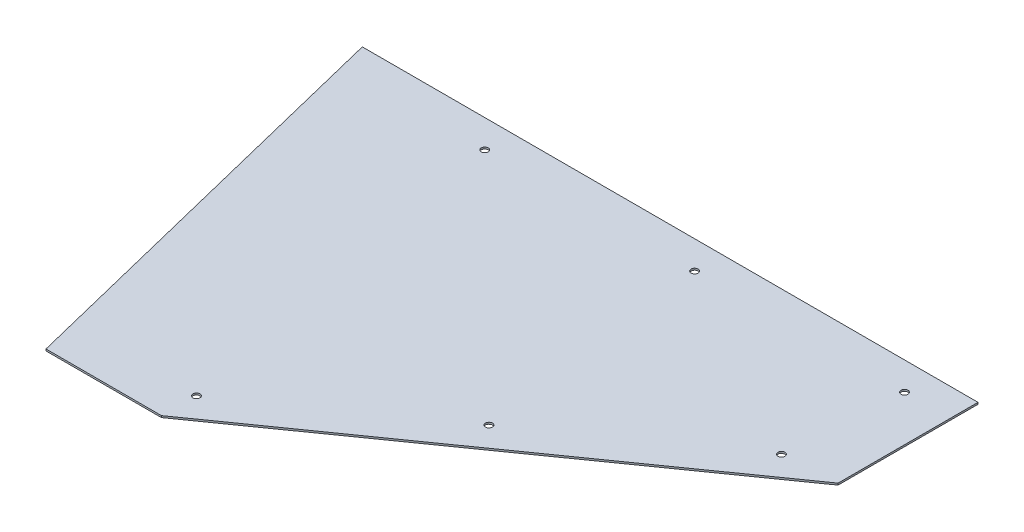
ISO-10303-21;
HEADER;
FILE_DESCRIPTION(('STEP AP214'),'2;1');
FILE_NAME('part.step','',(''),(''),'','','');
FILE_SCHEMA(('AUTOMOTIVE_DESIGN { 1 0 10303 214 1 1 1 1 }'));
ENDSEC;
DATA;
#1=APPLICATION_CONTEXT('core data for automotive mechanical design processes');
#2=APPLICATION_PROTOCOL_DEFINITION('international standard','automotive_design',2000,#1);
#3=PRODUCT_CONTEXT('',#1,'mechanical');
#4=PRODUCT('Part','Part','',(#3));
#5=PRODUCT_RELATED_PRODUCT_CATEGORY('part','',(#4));
#6=PRODUCT_DEFINITION_FORMATION('','',#4);
#7=PRODUCT_DEFINITION_CONTEXT('part definition',#1,'design');
#8=PRODUCT_DEFINITION('design','',#6,#7);
#9=PRODUCT_DEFINITION_SHAPE('','',#8);
#10=(LENGTH_UNIT() NAMED_UNIT(*) SI_UNIT(.MILLI.,.METRE.));
#11=(NAMED_UNIT(*) PLANE_ANGLE_UNIT() SI_UNIT($,.RADIAN.));
#12=(NAMED_UNIT(*) SI_UNIT($,.STERADIAN.) SOLID_ANGLE_UNIT());
#13=UNCERTAINTY_MEASURE_WITH_UNIT(LENGTH_MEASURE(1.E-05),#10,'distance_accuracy_value','');
#14=(GEOMETRIC_REPRESENTATION_CONTEXT(3) GLOBAL_UNCERTAINTY_ASSIGNED_CONTEXT((#13)) GLOBAL_UNIT_ASSIGNED_CONTEXT((#10,
#11,#12)) REPRESENTATION_CONTEXT('',''));
#15=CARTESIAN_POINT('',(0.,0.,0.));
#16=DIRECTION('',(0.,0.,1.));
#17=DIRECTION('',(1.,0.,0.));
#18=AXIS2_PLACEMENT_3D('',#15,#16,#17);
#19=CARTESIAN_POINT('',(-187.782690592478,3.175,-762.));
#20=DIRECTION('',(0.970951717770214,0.,-0.239275493436062));
#21=DIRECTION('',(-0.239275493436062,0.,-0.970951717770214));
#22=AXIS2_PLACEMENT_3D('',#19,#20,#21);
#23=PLANE('',#22);
#24=DIRECTION('',(0.239275493436062,0.,0.970951717770214));
#25=VECTOR('',#24,1.);
#26=CARTESIAN_POINT('',(-187.782690592478,0.,-762.));
#27=LINE('',#26,#25);
#28=CARTESIAN_POINT('',(-187.782690592478,0.,-762.));
#29=VERTEX_POINT('',#28);
#30=CARTESIAN_POINT('',(0.,0.,0.));
#31=VERTEX_POINT('',#30);
#32=EDGE_CURVE('E91',#29,#31,#27,.T.);
#33=ORIENTED_EDGE('',*,*,#32,.T.);
#34=DIRECTION('',(0.,-1.,0.));
#35=VECTOR('',#34,1.);
#36=CARTESIAN_POINT('',(0.,3.175,0.));
#37=LINE('',#36,#35);
#38=CARTESIAN_POINT('',(0.,3.175,0.));
#39=VERTEX_POINT('',#38);
#40=EDGE_CURVE('E11',#39,#31,#37,.T.);
#41=ORIENTED_EDGE('',*,*,#40,.F.);
#42=DIRECTION('',(0.239275493436062,0.,0.970951717770214));
#43=VECTOR('',#42,1.);
#44=CARTESIAN_POINT('',(-187.782690592478,3.175,-762.));
#45=LINE('',#44,#43);
#46=CARTESIAN_POINT('',(-187.782690592478,3.175,-762.));
#47=VERTEX_POINT('',#46);
#48=EDGE_CURVE('E100',#47,#39,#45,.T.);
#49=ORIENTED_EDGE('',*,*,#48,.F.);
#50=DIRECTION('',(0.,-1.,0.));
#51=VECTOR('',#50,1.);
#52=CARTESIAN_POINT('',(-187.782690592478,3.175,-762.));
#53=LINE('',#52,#51);
#54=EDGE_CURVE('E87',#47,#29,#53,.T.);
#55=ORIENTED_EDGE('',*,*,#54,.T.);
#56=EDGE_LOOP('',(#33,#41,#49,#55));
#57=FACE_BOUND('',#56,.T.);
#58=ADVANCED_FACE('F17',(#57),#23,.F.);
#59=CARTESIAN_POINT('',(0.,3.175,0.));
#60=DIRECTION('',(0.,0.,-1.));
#61=DIRECTION('',(-1.,0.,0.));
#62=AXIS2_PLACEMENT_3D('',#59,#60,#61);
#63=PLANE('',#62);
#64=DIRECTION('',(1.,0.,0.));
#65=VECTOR('',#64,1.);
#66=CARTESIAN_POINT('',(0.,0.,0.));
#67=LINE('',#66,#65);
#68=CARTESIAN_POINT('',(209.454195022671,0.,0.));
#69=VERTEX_POINT('',#68);
#70=EDGE_CURVE('E94',#31,#69,#67,.T.);
#71=ORIENTED_EDGE('',*,*,#70,.T.);
#72=DIRECTION('',(0.,-1.,0.));
#73=VECTOR('',#72,1.);
#74=CARTESIAN_POINT('',(209.454195022671,3.175,0.));
#75=LINE('',#74,#73);
#76=CARTESIAN_POINT('',(209.454195022671,3.175,0.));
#77=VERTEX_POINT('',#76);
#78=EDGE_CURVE('E25',#77,#69,#75,.T.);
#79=ORIENTED_EDGE('',*,*,#78,.F.);
#80=DIRECTION('',(1.,0.,0.));
#81=VECTOR('',#80,1.);
#82=CARTESIAN_POINT('',(0.,3.175,0.));
#83=LINE('',#82,#81);
#84=EDGE_CURVE('E67',#39,#77,#83,.T.);
#85=ORIENTED_EDGE('',*,*,#84,.F.);
#86=ORIENTED_EDGE('',*,*,#40,.T.);
#87=EDGE_LOOP('',(#71,#79,#85,#86));
#88=FACE_BOUND('',#87,.T.);
#89=ADVANCED_FACE('F122',(#88),#63,.F.);
#90=CARTESIAN_POINT('',(929.817309407521,3.175,-508.));
#91=DIRECTION('',(-0.576310896991402,0.,-0.817230536635144));
#92=DIRECTION('',(-0.817230536635144,0.,0.576310896991402));
#93=AXIS2_PLACEMENT_3D('',#90,#91,#92);
#94=PLANE('',#93);
#95=DIRECTION('',(0.817230536635144,0.,-0.576310896991402));
#96=VECTOR('',#95,1.);
#97=CARTESIAN_POINT('',(929.817309407521,0.,-508.));
#98=LINE('',#97,#96);
#99=CARTESIAN_POINT('',(929.817309407521,0.,-508.));
#100=VERTEX_POINT('',#99);
#101=EDGE_CURVE('E82',#69,#100,#98,.T.);
#102=ORIENTED_EDGE('',*,*,#101,.T.);
#103=DIRECTION('',(0.,-1.,0.));
#104=VECTOR('',#103,1.);
#105=CARTESIAN_POINT('',(929.817309407521,3.175,-508.));
#106=LINE('',#105,#104);
#107=CARTESIAN_POINT('',(929.817309407521,3.175,-508.));
#108=VERTEX_POINT('',#107);
#109=EDGE_CURVE('E79',#108,#100,#106,.T.);
#110=ORIENTED_EDGE('',*,*,#109,.F.);
#111=DIRECTION('',(0.817230536635144,0.,-0.576310896991402));
#112=VECTOR('',#111,1.);
#113=CARTESIAN_POINT('',(929.817309407521,3.175,-508.));
#114=LINE('',#113,#112);
#115=EDGE_CURVE('E71',#77,#108,#114,.T.);
#116=ORIENTED_EDGE('',*,*,#115,.F.);
#117=ORIENTED_EDGE('',*,*,#78,.T.);
#118=EDGE_LOOP('',(#102,#110,#116,#117));
#119=FACE_BOUND('',#118,.T.);
#120=ADVANCED_FACE('F80',(#119),#94,.F.);
#121=CARTESIAN_POINT('',(929.817309407521,3.175,-762.));
#122=DIRECTION('',(-1.,0.,0.));
#123=DIRECTION('',(0.,0.,1.));
#124=AXIS2_PLACEMENT_3D('',#121,#122,#123);
#125=PLANE('',#124);
#126=DIRECTION('',(0.,0.,-1.));
#127=VECTOR('',#126,1.);
#128=CARTESIAN_POINT('',(929.817309407521,0.,-762.));
#129=LINE('',#128,#127);
#130=CARTESIAN_POINT('',(929.817309407521,0.,-762.));
#131=VERTEX_POINT('',#130);
#132=EDGE_CURVE('E53',#100,#131,#129,.T.);
#133=ORIENTED_EDGE('',*,*,#132,.T.);
#134=DIRECTION('',(0.,-1.,0.));
#135=VECTOR('',#134,1.);
#136=CARTESIAN_POINT('',(929.817309407521,3.175,-762.));
#137=LINE('',#136,#135);
#138=CARTESIAN_POINT('',(929.817309407521,3.175,-762.));
#139=VERTEX_POINT('',#138);
#140=EDGE_CURVE('E83',#139,#131,#137,.T.);
#141=ORIENTED_EDGE('',*,*,#140,.F.);
#142=DIRECTION('',(0.,0.,-1.));
#143=VECTOR('',#142,1.);
#144=CARTESIAN_POINT('',(929.817309407521,3.175,-762.));
#145=LINE('',#144,#143);
#146=EDGE_CURVE('E75',#108,#139,#145,.T.);
#147=ORIENTED_EDGE('',*,*,#146,.F.);
#148=ORIENTED_EDGE('',*,*,#109,.T.);
#149=EDGE_LOOP('',(#133,#141,#147,#148));
#150=FACE_BOUND('',#149,.T.);
#151=ADVANCED_FACE('F85',(#150),#125,.F.);
#152=CARTESIAN_POINT('',(929.817309407521,3.175,-762.));
#153=DIRECTION('',(0.,0.,1.));
#154=DIRECTION('',(1.,0.,0.));
#155=AXIS2_PLACEMENT_3D('',#152,#153,#154);
#156=PLANE('',#155);
#157=DIRECTION('',(-1.,0.,0.));
#158=VECTOR('',#157,1.);
#159=CARTESIAN_POINT('',(929.817309407521,0.,-762.));
#160=LINE('',#159,#158);
#161=EDGE_CURVE('E59',#131,#29,#160,.T.);
#162=ORIENTED_EDGE('',*,*,#161,.T.);
#163=ORIENTED_EDGE('',*,*,#54,.F.);
#164=DIRECTION('',(-1.,0.,0.));
#165=VECTOR('',#164,1.);
#166=CARTESIAN_POINT('',(929.817309407521,3.175,-762.));
#167=LINE('',#166,#165);
#168=EDGE_CURVE('E33',#139,#47,#167,.T.);
#169=ORIENTED_EDGE('',*,*,#168,.F.);
#170=ORIENTED_EDGE('',*,*,#140,.T.);
#171=EDGE_LOOP('',(#162,#163,#169,#170));
#172=FACE_BOUND('',#171,.T.);
#173=ADVANCED_FACE('F108',(#172),#156,.F.);
#174=CARTESIAN_POINT('',(0.,3.175,0.));
#175=DIRECTION('',(0.,1.,0.));
#176=DIRECTION('',(0.,0.,1.));
#177=AXIS2_PLACEMENT_3D('',#174,#175,#176);
#178=PLANE('',#177);
#179=CARTESIAN_POINT('',(210.348666125147,3.175,-62.7919432069763));
#180=DIRECTION('',(0.,1.,0.));
#181=DIRECTION('',(0.,0.,1.));
#182=AXIS2_PLACEMENT_3D('',#179,#180,#181);
#183=CIRCLE('',#182,6.35);
#184=CARTESIAN_POINT('',(210.348666125147,3.175,-56.4419432069763));
#185=VERTEX_POINT('',#184);
#186=EDGE_CURVE('E231',#185,#185,#183,.T.);
#187=ORIENTED_EDGE('',*,*,#186,.F.);
#188=EDGE_LOOP('',(#187));
#189=FACE_BOUND('',#188,.T.);
#190=CARTESIAN_POINT('',(521.713500583137,3.175,-282.366394960701));
#191=DIRECTION('',(0.,1.,0.));
#192=DIRECTION('',(0.,0.,1.));
#193=AXIS2_PLACEMENT_3D('',#190,#191,#192);
#194=CIRCLE('',#193,6.35);
#195=CARTESIAN_POINT('',(521.713500583137,3.175,-276.0163949607));
#196=VERTEX_POINT('',#195);
#197=EDGE_CURVE('E235',#196,#196,#194,.T.);
#198=ORIENTED_EDGE('',*,*,#197,.F.);
#199=EDGE_LOOP('',(#198));
#200=FACE_BOUND('',#199,.T.);
#201=CARTESIAN_POINT('',(833.078335041127,3.175,-501.940846714425));
#202=DIRECTION('',(0.,1.,0.));
#203=DIRECTION('',(0.,0.,1.));
#204=AXIS2_PLACEMENT_3D('',#201,#202,#203);
#205=CIRCLE('',#204,6.35);
#206=CARTESIAN_POINT('',(833.078335041127,3.175,-495.590846714425));
#207=VERTEX_POINT('',#206);
#208=EDGE_CURVE('E244',#207,#207,#205,.T.);
#209=ORIENTED_EDGE('',*,*,#208,.F.);
#210=EDGE_LOOP('',(#209));
#211=FACE_BOUND('',#210,.T.);
#212=CARTESIAN_POINT('',(85.2673094075211,3.175,-711.2));
#213=DIRECTION('',(0.,1.,0.));
#214=DIRECTION('',(0.,0.,1.));
#215=AXIS2_PLACEMENT_3D('',#212,#213,#214);
#216=CIRCLE('',#215,6.35);
#217=CARTESIAN_POINT('',(85.2673094075211,3.175,-704.85));
#218=VERTEX_POINT('',#217);
#219=EDGE_CURVE('E250',#218,#218,#216,.T.);
#220=ORIENTED_EDGE('',*,*,#219,.F.);
#221=EDGE_LOOP('',(#220));
#222=FACE_BOUND('',#221,.T.);
#223=CARTESIAN_POINT('',(466.267309407521,3.175,-711.2));
#224=DIRECTION('',(0.,1.,0.));
#225=DIRECTION('',(0.,0.,1.));
#226=AXIS2_PLACEMENT_3D('',#223,#224,#225);
#227=CIRCLE('',#226,6.35);
#228=CARTESIAN_POINT('',(466.267309407521,3.175,-704.85));
#229=VERTEX_POINT('',#228);
#230=EDGE_CURVE('E256',#229,#229,#227,.T.);
#231=ORIENTED_EDGE('',*,*,#230,.F.);
#232=EDGE_LOOP('',(#231));
#233=FACE_BOUND('',#232,.T.);
#234=CARTESIAN_POINT('',(847.267309407521,3.175,-711.2));
#235=DIRECTION('',(0.,1.,0.));
#236=DIRECTION('',(0.,0.,1.));
#237=AXIS2_PLACEMENT_3D('',#234,#235,#236);
#238=CIRCLE('',#237,6.35);
#239=CARTESIAN_POINT('',(847.267309407521,3.175,-704.85));
#240=VERTEX_POINT('',#239);
#241=EDGE_CURVE('E262',#240,#240,#238,.T.);
#242=ORIENTED_EDGE('',*,*,#241,.F.);
#243=EDGE_LOOP('',(#242));
#244=FACE_BOUND('',#243,.T.);
#245=ORIENTED_EDGE('',*,*,#48,.T.);
#246=ORIENTED_EDGE('',*,*,#84,.T.);
#247=ORIENTED_EDGE('',*,*,#115,.T.);
#248=ORIENTED_EDGE('',*,*,#146,.T.);
#249=ORIENTED_EDGE('',*,*,#168,.T.);
#250=EDGE_LOOP('',(#245,#246,#247,#248,#249));
#251=FACE_BOUND('',#250,.T.);
#252=ADVANCED_FACE('F73',(#189,#200,#211,#222,#233,#244,#251),#178,.T.);
#253=CARTESIAN_POINT('',(0.,0.,0.));
#254=DIRECTION('',(0.,1.,0.));
#255=DIRECTION('',(0.,0.,1.));
#256=AXIS2_PLACEMENT_3D('',#253,#254,#255);
#257=PLANE('',#256);
#258=CARTESIAN_POINT('',(210.348666125147,0.,-62.7919432069763));
#259=DIRECTION('',(0.,1.,0.));
#260=DIRECTION('',(0.,0.,1.));
#261=AXIS2_PLACEMENT_3D('',#258,#259,#260);
#262=CIRCLE('',#261,6.35);
#263=CARTESIAN_POINT('',(210.348666125147,0.,-56.4419432069763));
#264=VERTEX_POINT('',#263);
#265=EDGE_CURVE('E234',#264,#264,#262,.F.);
#266=ORIENTED_EDGE('',*,*,#265,.F.);
#267=EDGE_LOOP('',(#266));
#268=FACE_BOUND('',#267,.T.);
#269=CARTESIAN_POINT('',(521.713500583137,0.,-282.366394960701));
#270=DIRECTION('',(0.,1.,0.));
#271=DIRECTION('',(0.,0.,1.));
#272=AXIS2_PLACEMENT_3D('',#269,#270,#271);
#273=CIRCLE('',#272,6.35);
#274=CARTESIAN_POINT('',(521.713500583137,0.,-276.0163949607));
#275=VERTEX_POINT('',#274);
#276=EDGE_CURVE('E238',#275,#275,#273,.F.);
#277=ORIENTED_EDGE('',*,*,#276,.F.);
#278=EDGE_LOOP('',(#277));
#279=FACE_BOUND('',#278,.T.);
#280=CARTESIAN_POINT('',(833.078335041127,0.,-501.940846714425));
#281=DIRECTION('',(0.,1.,0.));
#282=DIRECTION('',(0.,0.,1.));
#283=AXIS2_PLACEMENT_3D('',#280,#281,#282);
#284=CIRCLE('',#283,6.35);
#285=CARTESIAN_POINT('',(833.078335041127,0.,-495.590846714425));
#286=VERTEX_POINT('',#285);
#287=EDGE_CURVE('E247',#286,#286,#284,.F.);
#288=ORIENTED_EDGE('',*,*,#287,.F.);
#289=EDGE_LOOP('',(#288));
#290=FACE_BOUND('',#289,.T.);
#291=CARTESIAN_POINT('',(85.2673094075211,0.,-711.2));
#292=DIRECTION('',(0.,1.,0.));
#293=DIRECTION('',(0.,0.,1.));
#294=AXIS2_PLACEMENT_3D('',#291,#292,#293);
#295=CIRCLE('',#294,6.35);
#296=CARTESIAN_POINT('',(85.2673094075211,0.,-704.85));
#297=VERTEX_POINT('',#296);
#298=EDGE_CURVE('E253',#297,#297,#295,.F.);
#299=ORIENTED_EDGE('',*,*,#298,.F.);
#300=EDGE_LOOP('',(#299));
#301=FACE_BOUND('',#300,.T.);
#302=CARTESIAN_POINT('',(466.267309407521,0.,-711.2));
#303=DIRECTION('',(0.,1.,0.));
#304=DIRECTION('',(0.,0.,1.));
#305=AXIS2_PLACEMENT_3D('',#302,#303,#304);
#306=CIRCLE('',#305,6.35);
#307=CARTESIAN_POINT('',(466.267309407521,0.,-704.85));
#308=VERTEX_POINT('',#307);
#309=EDGE_CURVE('E259',#308,#308,#306,.F.);
#310=ORIENTED_EDGE('',*,*,#309,.F.);
#311=EDGE_LOOP('',(#310));
#312=FACE_BOUND('',#311,.T.);
#313=CARTESIAN_POINT('',(847.267309407521,0.,-711.2));
#314=DIRECTION('',(0.,1.,0.));
#315=DIRECTION('',(0.,0.,1.));
#316=AXIS2_PLACEMENT_3D('',#313,#314,#315);
#317=CIRCLE('',#316,6.35);
#318=CARTESIAN_POINT('',(847.267309407521,0.,-704.85));
#319=VERTEX_POINT('',#318);
#320=EDGE_CURVE('E95',#319,#319,#317,.F.);
#321=ORIENTED_EDGE('',*,*,#320,.F.);
#322=EDGE_LOOP('',(#321));
#323=FACE_BOUND('',#322,.T.);
#324=ORIENTED_EDGE('',*,*,#32,.F.);
#325=ORIENTED_EDGE('',*,*,#161,.F.);
#326=ORIENTED_EDGE('',*,*,#132,.F.);
#327=ORIENTED_EDGE('',*,*,#101,.F.);
#328=ORIENTED_EDGE('',*,*,#70,.F.);
#329=EDGE_LOOP('',(#324,#325,#326,#327,#328));
#330=FACE_BOUND('',#329,.T.);
#331=ADVANCED_FACE('F104',(#268,#279,#290,#301,#312,#323,#330),#257,.F.);
#332=CARTESIAN_POINT('',(847.267309407521,-0.00100000000000013,-711.2));
#333=DIRECTION('',(0.,1.,0.));
#334=DIRECTION('',(0.,0.,1.));
#335=AXIS2_PLACEMENT_3D('',#332,#333,#334);
#336=CYLINDRICAL_SURFACE('',#335,6.35);
#337=ORIENTED_EDGE('',*,*,#241,.T.);
#338=EDGE_LOOP('',(#337));
#339=FACE_BOUND('',#338,.T.);
#340=ORIENTED_EDGE('',*,*,#320,.T.);
#341=EDGE_LOOP('',(#340));
#342=FACE_BOUND('',#341,.T.);
#343=ADVANCED_FACE('F163',(#339,#342),#336,.F.);
#344=CARTESIAN_POINT('',(466.267309407521,-0.00100000000000013,-711.2));
#345=DIRECTION('',(0.,1.,0.));
#346=DIRECTION('',(0.,0.,1.));
#347=AXIS2_PLACEMENT_3D('',#344,#345,#346);
#348=CYLINDRICAL_SURFACE('',#347,6.35);
#349=ORIENTED_EDGE('',*,*,#230,.T.);
#350=EDGE_LOOP('',(#349));
#351=FACE_BOUND('',#350,.T.);
#352=ORIENTED_EDGE('',*,*,#309,.T.);
#353=EDGE_LOOP('',(#352));
#354=FACE_BOUND('',#353,.T.);
#355=ADVANCED_FACE('F172',(#351,#354),#348,.F.);
#356=CARTESIAN_POINT('',(85.2673094075211,-0.00100000000000013,-711.2));
#357=DIRECTION('',(0.,1.,0.));
#358=DIRECTION('',(0.,0.,1.));
#359=AXIS2_PLACEMENT_3D('',#356,#357,#358);
#360=CYLINDRICAL_SURFACE('',#359,6.35);
#361=ORIENTED_EDGE('',*,*,#219,.T.);
#362=EDGE_LOOP('',(#361));
#363=FACE_BOUND('',#362,.T.);
#364=ORIENTED_EDGE('',*,*,#298,.T.);
#365=EDGE_LOOP('',(#364));
#366=FACE_BOUND('',#365,.T.);
#367=ADVANCED_FACE('F182',(#363,#366),#360,.F.);
#368=CARTESIAN_POINT('',(833.078335041127,-0.00100000000000013,-501.940846714425));
#369=DIRECTION('',(0.,1.,0.));
#370=DIRECTION('',(0.,0.,1.));
#371=AXIS2_PLACEMENT_3D('',#368,#369,#370);
#372=CYLINDRICAL_SURFACE('',#371,6.35);
#373=ORIENTED_EDGE('',*,*,#208,.T.);
#374=EDGE_LOOP('',(#373));
#375=FACE_BOUND('',#374,.T.);
#376=ORIENTED_EDGE('',*,*,#287,.T.);
#377=EDGE_LOOP('',(#376));
#378=FACE_BOUND('',#377,.T.);
#379=ADVANCED_FACE('F192',(#375,#378),#372,.F.);
#380=CARTESIAN_POINT('',(521.713500583137,-0.00100000000000013,-282.366394960701));
#381=DIRECTION('',(0.,1.,0.));
#382=DIRECTION('',(0.,0.,1.));
#383=AXIS2_PLACEMENT_3D('',#380,#381,#382);
#384=CYLINDRICAL_SURFACE('',#383,6.35);
#385=ORIENTED_EDGE('',*,*,#197,.T.);
#386=EDGE_LOOP('',(#385));
#387=FACE_BOUND('',#386,.T.);
#388=ORIENTED_EDGE('',*,*,#276,.T.);
#389=EDGE_LOOP('',(#388));
#390=FACE_BOUND('',#389,.T.);
#391=ADVANCED_FACE('F202',(#387,#390),#384,.F.);
#392=CARTESIAN_POINT('',(210.348666125147,-0.00100000000000013,-62.7919432069763));
#393=DIRECTION('',(0.,1.,0.));
#394=DIRECTION('',(0.,0.,1.));
#395=AXIS2_PLACEMENT_3D('',#392,#393,#394);
#396=CYLINDRICAL_SURFACE('',#395,6.35);
#397=ORIENTED_EDGE('',*,*,#186,.T.);
#398=EDGE_LOOP('',(#397));
#399=FACE_BOUND('',#398,.T.);
#400=ORIENTED_EDGE('',*,*,#265,.T.);
#401=EDGE_LOOP('',(#400));
#402=FACE_BOUND('',#401,.T.);
#403=ADVANCED_FACE('F212',(#399,#402),#396,.F.);
#404=CLOSED_SHELL('',(#58,#89,#120,#151,#173,#252,#331,#343,#355,#367,#379,#391,#403));
#405=MANIFOLD_SOLID_BREP('B1',#404);
#406=ADVANCED_BREP_SHAPE_REPRESENTATION('',(#18,#405),#14);
#407=SHAPE_DEFINITION_REPRESENTATION(#9,#406);
ENDSEC;
END-ISO-10303-21;
